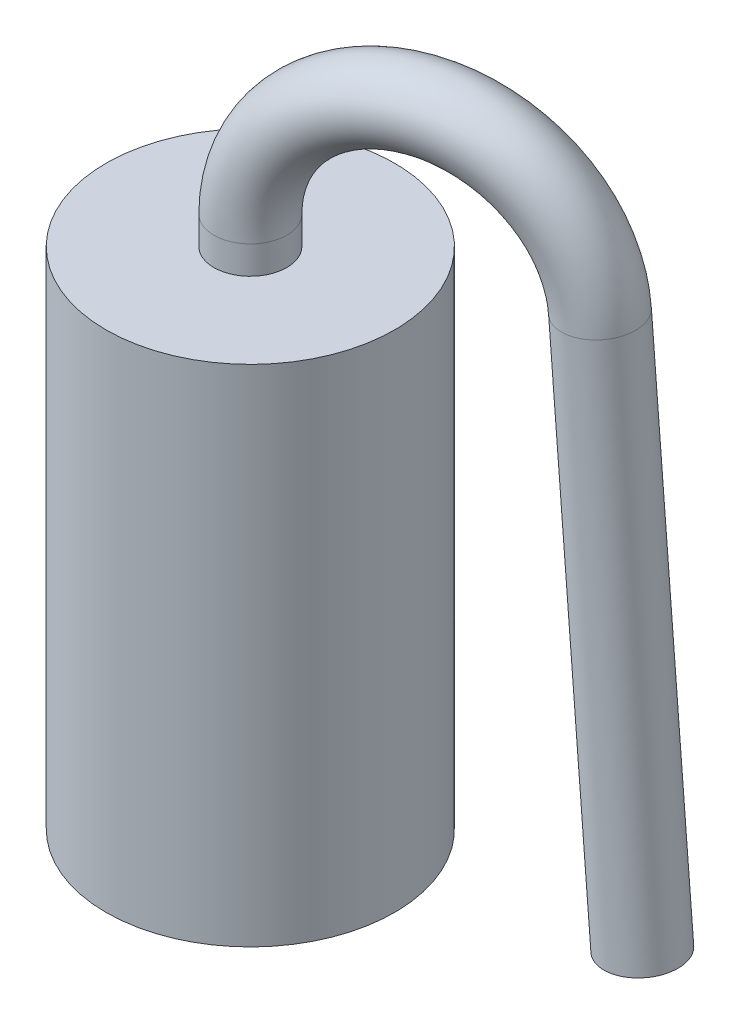
ISO-10303-21;
HEADER;
FILE_DESCRIPTION(('STEP AP214'),'2;1');
FILE_NAME('part.step','',(''),(''),'','','');
FILE_SCHEMA(('AUTOMOTIVE_DESIGN { 1 0 10303 214 1 1 1 1 }'));
ENDSEC;
DATA;
#1=APPLICATION_CONTEXT('core data for automotive mechanical design processes');
#2=APPLICATION_PROTOCOL_DEFINITION('international standard','automotive_design',2000,#1);
#3=PRODUCT_CONTEXT('',#1,'mechanical');
#4=PRODUCT('Part','Part','',(#3));
#5=PRODUCT_RELATED_PRODUCT_CATEGORY('part','',(#4));
#6=PRODUCT_DEFINITION_FORMATION('','',#4);
#7=PRODUCT_DEFINITION_CONTEXT('part definition',#1,'design');
#8=PRODUCT_DEFINITION('design','',#6,#7);
#9=PRODUCT_DEFINITION_SHAPE('','',#8);
#10=(LENGTH_UNIT() NAMED_UNIT(*) SI_UNIT(.MILLI.,.METRE.));
#11=(NAMED_UNIT(*) PLANE_ANGLE_UNIT() SI_UNIT($,.RADIAN.));
#12=(NAMED_UNIT(*) SI_UNIT($,.STERADIAN.) SOLID_ANGLE_UNIT());
#13=UNCERTAINTY_MEASURE_WITH_UNIT(LENGTH_MEASURE(1.E-05),#10,'distance_accuracy_value','');
#14=(GEOMETRIC_REPRESENTATION_CONTEXT(3) GLOBAL_UNCERTAINTY_ASSIGNED_CONTEXT((#13)) GLOBAL_UNIT_ASSIGNED_CONTEXT((#10,
#11,#12)) REPRESENTATION_CONTEXT('',''));
#15=CARTESIAN_POINT('',(0.,0.,0.));
#16=DIRECTION('',(0.,0.,1.));
#17=DIRECTION('',(1.,0.,0.));
#18=AXIS2_PLACEMENT_3D('',#15,#16,#17);
#19=CARTESIAN_POINT('',(-8.598963556757,3.947980609798,14.533036205065));
#20=DIRECTION('',(0.059787729916578,-0.998043740313633,-0.0182789434102633));
#21=DIRECTION('',(0.99821051518046,0.0597977205515492,0.));
#22=AXIS2_PLACEMENT_3D('',#19,#20,#21);
#23=PLANE('',#22);
#24=CARTESIAN_POINT('',(-8.59896355675745,3.94798060979761,14.5330362050649));
#25=DIRECTION('',(-0.059787729916578,0.998043740313633,0.0182789434102633));
#26=DIRECTION('',(-0.99821051518046,-0.0597977205515492,0.));
#27=AXIS2_PLACEMENT_3D('',#24,#25,#26);
#28=CIRCLE('',#27,0.65);
#29=CARTESIAN_POINT('',(-9.24780039162475,3.9091120914391,14.5330362050649));
#30=VERTEX_POINT('',#29);
#31=EDGE_CURVE('E18',#30,#30,#28,.T.);
#32=ORIENTED_EDGE('',*,*,#31,.F.);
#33=EDGE_LOOP('',(#32));
#34=FACE_BOUND('',#33,.T.);
#35=ADVANCED_FACE('F15',(#34),#23,.T.);
#36=CARTESIAN_POINT('',(-9.17742336144,13.60427945058,14.709889115347));
#37=DIRECTION('',(-0.059787729916578,0.998043740313633,0.0182789434102633));
#38=DIRECTION('',(-0.99821051518046,-0.0597977205515492,0.));
#39=AXIS2_PLACEMENT_3D('',#36,#37,#38);
#40=CYLINDRICAL_SURFACE('',#39,0.65);
#41=CARTESIAN_POINT('',(-9.17742336143757,13.6042794505806,14.709889115347));
#42=DIRECTION('',(0.0597877299167753,-0.99804374031362,-0.0182789434103392));
#43=DIRECTION('',(0.954433975520975,0.062519536313057,-0.291799749743597));
#44=AXIS2_PLACEMENT_3D('',#41,#42,#43);
#45=CIRCLE('',#44,0.65);
#46=CARTESIAN_POINT('',(-8.55704127734893,13.6449171491841,14.5202192780137));
#47=VERTEX_POINT('',#46);
#48=EDGE_CURVE('E30',#47,#47,#45,.F.);
#49=ORIENTED_EDGE('',*,*,#48,.F.);
#50=EDGE_LOOP('',(#49));
#51=FACE_BOUND('',#50,.T.);
#52=ORIENTED_EDGE('',*,*,#31,.T.);
#53=EDGE_LOOP('',(#52));
#54=FACE_BOUND('',#53,.T.);
#55=ADVANCED_FACE('F47',(#51,#54),#40,.T.);
#56=CARTESIAN_POINT('',(-11.56350830024,13.447980609798,15.439388489706));
#57=DIRECTION('',(-0.292371704722987,0.,-0.956304755962959));
#58=DIRECTION('',(-0.956304755962959,0.,0.292371704722987));
#59=AXIS2_PLACEMENT_3D('',#56,#57,#58);
#60=TOROIDAL_SURFACE('',#59,2.5,0.65);
#61=ORIENTED_EDGE('',*,*,#48,.T.);
#62=EDGE_LOOP('',(#61));
#63=FACE_BOUND('',#62,.T.);
#64=CARTESIAN_POINT('',(-13.95427019015,13.447980609798,16.170317751512));
#65=DIRECTION('',(0.,1.,0.));
#66=DIRECTION('',(0.,0.,1.));
#67=AXIS2_PLACEMENT_3D('',#64,#65,#66);
#68=CIRCLE('',#67,0.65);
#69=CARTESIAN_POINT('',(-13.95427019015,13.447980609798,16.820317751512));
#70=VERTEX_POINT('',#69);
#71=EDGE_CURVE('E33',#70,#70,#68,.F.);
#72=ORIENTED_EDGE('',*,*,#71,.F.);
#73=EDGE_LOOP('',(#72));
#74=FACE_BOUND('',#73,.T.);
#75=ADVANCED_FACE('F43',(#63,#74),#60,.T.);
#76=CARTESIAN_POINT('',(-13.95427019015,13.447980609798,16.170317751512));
#77=DIRECTION('',(0.,1.,0.));
#78=DIRECTION('',(0.,0.,1.));
#79=AXIS2_PLACEMENT_3D('',#76,#77,#78);
#80=CYLINDRICAL_SURFACE('',#79,0.65);
#81=CARTESIAN_POINT('',(-13.95427019015,12.947980609798,16.170317751512));
#82=DIRECTION('',(0.,1.,0.));
#83=DIRECTION('',(0.,0.,1.));
#84=AXIS2_PLACEMENT_3D('',#81,#82,#83);
#85=CIRCLE('',#84,0.65);
#86=CARTESIAN_POINT('',(-13.95427019015,12.947980609798,16.820317751512));
#87=VERTEX_POINT('',#86);
#88=EDGE_CURVE('E27',#87,#87,#85,.F.);
#89=ORIENTED_EDGE('',*,*,#88,.F.);
#90=EDGE_LOOP('',(#89));
#91=FACE_BOUND('',#90,.T.);
#92=ORIENTED_EDGE('',*,*,#71,.T.);
#93=EDGE_LOOP('',(#92));
#94=FACE_BOUND('',#93,.T.);
#95=ADVANCED_FACE('F46',(#91,#94),#80,.T.);
#96=CARTESIAN_POINT('',(-13.95427019015,12.947980609798,16.170317751512));
#97=DIRECTION('',(0.,1.,0.));
#98=DIRECTION('',(0.,0.,1.));
#99=AXIS2_PLACEMENT_3D('',#96,#97,#98);
#100=PLANE('',#99);
#101=ORIENTED_EDGE('',*,*,#88,.T.);
#102=EDGE_LOOP('',(#101));
#103=FACE_BOUND('',#102,.T.);
#104=CARTESIAN_POINT('',(-13.95427019015,12.947980609798,16.170317751512));
#105=DIRECTION('',(0.,1.,0.));
#106=DIRECTION('',(0.,0.,1.));
#107=AXIS2_PLACEMENT_3D('',#104,#105,#106);
#108=CIRCLE('',#107,2.575);
#109=CARTESIAN_POINT('',(-13.95427019015,12.947980609798,18.745317751512));
#110=VERTEX_POINT('',#109);
#111=EDGE_CURVE('E22',#110,#110,#108,.F.);
#112=ORIENTED_EDGE('',*,*,#111,.F.);
#113=EDGE_LOOP('',(#112));
#114=FACE_BOUND('',#113,.T.);
#115=ADVANCED_FACE('F67',(#103,#114),#100,.T.);
#116=CARTESIAN_POINT('',(-13.95427019015,3.947980609798,16.170317751512));
#117=DIRECTION('',(0.,1.,0.));
#118=DIRECTION('',(0.,0.,1.));
#119=AXIS2_PLACEMENT_3D('',#116,#117,#118);
#120=PLANE('',#119);
#121=CARTESIAN_POINT('',(-13.95427019015,3.947980609798,16.170317751512));
#122=DIRECTION('',(0.,1.,0.));
#123=DIRECTION('',(0.,0.,1.));
#124=AXIS2_PLACEMENT_3D('',#121,#122,#123);
#125=CIRCLE('',#124,2.575);
#126=CARTESIAN_POINT('',(-13.95427019015,3.947980609798,18.745317751512));
#127=VERTEX_POINT('',#126);
#128=EDGE_CURVE('E10',#127,#127,#125,.T.);
#129=ORIENTED_EDGE('',*,*,#128,.F.);
#130=EDGE_LOOP('',(#129));
#131=FACE_BOUND('',#130,.T.);
#132=ADVANCED_FACE('F61',(#131),#120,.F.);
#133=CARTESIAN_POINT('',(-13.95427019015,12.947980609798,16.170317751512));
#134=DIRECTION('',(0.,1.,0.));
#135=DIRECTION('',(0.,0.,1.));
#136=AXIS2_PLACEMENT_3D('',#133,#134,#135);
#137=CYLINDRICAL_SURFACE('',#136,2.575);
#138=ORIENTED_EDGE('',*,*,#111,.T.);
#139=EDGE_LOOP('',(#138));
#140=FACE_BOUND('',#139,.T.);
#141=ORIENTED_EDGE('',*,*,#128,.T.);
#142=EDGE_LOOP('',(#141));
#143=FACE_BOUND('',#142,.T.);
#144=ADVANCED_FACE('F59',(#140,#143),#137,.T.);
#145=CLOSED_SHELL('',(#35,#55,#75,#95,#115,#132,#144));
#146=MANIFOLD_SOLID_BREP('B1',#145);
#147=ADVANCED_BREP_SHAPE_REPRESENTATION('',(#18,#146),#14);
#148=SHAPE_DEFINITION_REPRESENTATION(#9,#147);
ENDSEC;
END-ISO-10303-21;
